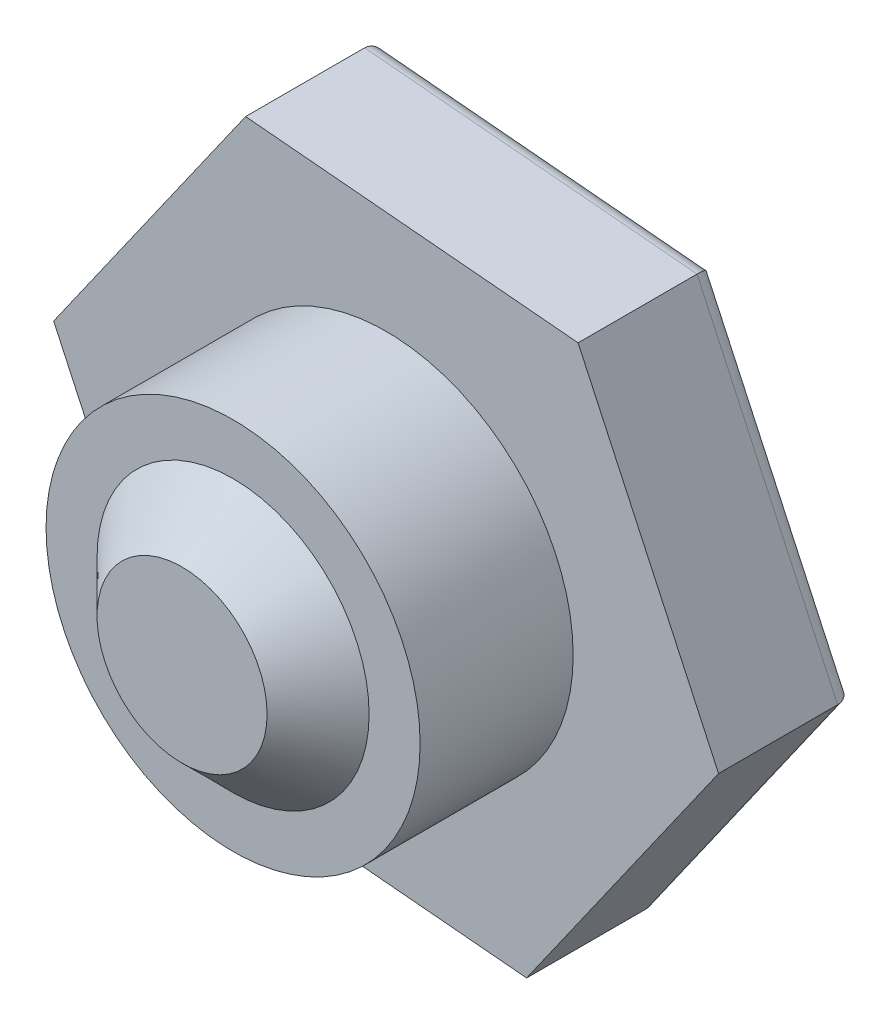
ISO-10303-21;
HEADER;
FILE_DESCRIPTION(('STEP AP214'),'2;1');
FILE_NAME('part.step','',(''),(''),'','','');
FILE_SCHEMA(('AUTOMOTIVE_DESIGN { 1 0 10303 214 1 1 1 1 }'));
ENDSEC;
DATA;
#1=APPLICATION_CONTEXT('core data for automotive mechanical design processes');
#2=APPLICATION_PROTOCOL_DEFINITION('international standard','automotive_design',2000,#1);
#3=PRODUCT_CONTEXT('',#1,'mechanical');
#4=PRODUCT('Part','Part','',(#3));
#5=PRODUCT_RELATED_PRODUCT_CATEGORY('part','',(#4));
#6=PRODUCT_DEFINITION_FORMATION('','',#4);
#7=PRODUCT_DEFINITION_CONTEXT('part definition',#1,'design');
#8=PRODUCT_DEFINITION('design','',#6,#7);
#9=PRODUCT_DEFINITION_SHAPE('','',#8);
#10=(LENGTH_UNIT() NAMED_UNIT(*) SI_UNIT(.MILLI.,.METRE.));
#11=(NAMED_UNIT(*) PLANE_ANGLE_UNIT() SI_UNIT($,.RADIAN.));
#12=(NAMED_UNIT(*) SI_UNIT($,.STERADIAN.) SOLID_ANGLE_UNIT());
#13=UNCERTAINTY_MEASURE_WITH_UNIT(LENGTH_MEASURE(1.E-05),#10,'distance_accuracy_value','');
#14=(GEOMETRIC_REPRESENTATION_CONTEXT(3) GLOBAL_UNCERTAINTY_ASSIGNED_CONTEXT((#13)) GLOBAL_UNIT_ASSIGNED_CONTEXT((#10,
#11,#12)) REPRESENTATION_CONTEXT('',''));
#15=CARTESIAN_POINT('',(0.,0.,0.));
#16=DIRECTION('',(0.,0.,1.));
#17=DIRECTION('',(1.,0.,0.));
#18=AXIS2_PLACEMENT_3D('',#15,#16,#17);
#19=CARTESIAN_POINT('',(0.,0.,9.));
#20=DIRECTION('',(0.,0.,1.));
#21=DIRECTION('',(1.,0.,0.));
#22=AXIS2_PLACEMENT_3D('',#19,#20,#21);
#23=PLANE('',#22);
#24=CARTESIAN_POINT('',(0.,0.,9.));
#25=DIRECTION('',(0.,0.,1.));
#26=DIRECTION('',(1.,0.,0.));
#27=AXIS2_PLACEMENT_3D('',#24,#25,#26);
#28=CIRCLE('',#27,11.);
#29=CARTESIAN_POINT('',(11.,0.,9.));
#30=VERTEX_POINT('',#29);
#31=EDGE_CURVE('E158',#30,#30,#28,.T.);
#32=ORIENTED_EDGE('',*,*,#31,.T.);
#33=EDGE_LOOP('',(#32));
#34=FACE_BOUND('',#33,.T.);
#35=CARTESIAN_POINT('',(0.,0.,9.));
#36=DIRECTION('',(0.,0.,1.));
#37=DIRECTION('',(1.,0.,0.));
#38=AXIS2_PLACEMENT_3D('',#35,#36,#37);
#39=CIRCLE('',#38,8.);
#40=CARTESIAN_POINT('',(8.,0.,9.));
#41=VERTEX_POINT('',#40);
#42=EDGE_CURVE('E413',#41,#41,#39,.T.);
#43=ORIENTED_EDGE('',*,*,#42,.F.);
#44=EDGE_LOOP('',(#43));
#45=FACE_BOUND('',#44,.T.);
#46=ADVANCED_FACE('F40',(#34,#45),#23,.T.);
#47=CARTESIAN_POINT('',(0.,0.,9.));
#48=DIRECTION('',(0.,0.,-1.));
#49=DIRECTION('',(-1.,0.,0.));
#50=AXIS2_PLACEMENT_3D('',#47,#48,#49);
#51=CYLINDRICAL_SURFACE('',#50,11.);
#52=ORIENTED_EDGE('',*,*,#31,.F.);
#53=EDGE_LOOP('',(#52));
#54=FACE_BOUND('',#53,.T.);
#55=CARTESIAN_POINT('',(0.,0.,0.));
#56=DIRECTION('',(0.,0.,1.));
#57=DIRECTION('',(1.,0.,0.));
#58=AXIS2_PLACEMENT_3D('',#55,#56,#57);
#59=CIRCLE('',#58,11.);
#60=CARTESIAN_POINT('',(11.,0.,0.));
#61=VERTEX_POINT('',#60);
#62=EDGE_CURVE('E118',#61,#61,#59,.T.);
#63=ORIENTED_EDGE('',*,*,#62,.T.);
#64=EDGE_LOOP('',(#63));
#65=FACE_BOUND('',#64,.T.);
#66=ADVANCED_FACE('F240',(#54,#65),#51,.T.);
#67=CARTESIAN_POINT('',(11.2892059741535,16.0588655205301,-8.));
#68=DIRECTION('',(-0.907093954646099,-0.420928209371267,0.));
#69=DIRECTION('',(0.420928209371267,-0.907093954646099,0.));
#70=AXIS2_PLACEMENT_3D('',#67,#68,#69);
#71=PLANE('',#70);
#72=DIRECTION('',(0.,0.,1.));
#73=VECTOR('',#72,1.);
#74=CARTESIAN_POINT('',(19.5519884838138,-1.74730640190698,-8.));
#75=LINE('',#74,#73);
#76=CARTESIAN_POINT('',(19.5519884838138,-1.74730640190698,-7.));
#77=VERTEX_POINT('',#76);
#78=CARTESIAN_POINT('',(19.5519884838138,-1.74730640190698,0.));
#79=VERTEX_POINT('',#78);
#80=EDGE_CURVE('E110',#77,#79,#75,.T.);
#81=ORIENTED_EDGE('',*,*,#80,.F.);
#82=DIRECTION('',(0.420928209371267,-0.907093954646099,0.));
#83=VECTOR('',#82,1.);
#84=CARTESIAN_POINT('',(11.2892059741535,16.0588655205301,-7.));
#85=LINE('',#84,#83);
#86=CARTESIAN_POINT('',(11.2892059741535,16.0588655205301,-7.));
#87=VERTEX_POINT('',#86);
#88=EDGE_CURVE('E12',#77,#87,#85,.F.);
#89=ORIENTED_EDGE('',*,*,#88,.T.);
#90=DIRECTION('',(0.,0.,1.));
#91=VECTOR('',#90,1.);
#92=CARTESIAN_POINT('',(11.2892059741535,16.0588655205301,-8.));
#93=LINE('',#92,#91);
#94=CARTESIAN_POINT('',(11.2892059741535,16.0588655205301,0.));
#95=VERTEX_POINT('',#94);
#96=EDGE_CURVE('E132',#87,#95,#93,.T.);
#97=ORIENTED_EDGE('',*,*,#96,.T.);
#98=DIRECTION('',(0.420928209371267,-0.907093954646099,0.));
#99=VECTOR('',#98,1.);
#100=CARTESIAN_POINT('',(11.2892059741535,16.0588655205301,0.));
#101=LINE('',#100,#99);
#102=EDGE_CURVE('E125',#95,#79,#101,.T.);
#103=ORIENTED_EDGE('',*,*,#102,.T.);
#104=EDGE_LOOP('',(#81,#89,#97,#103));
#105=FACE_BOUND('',#104,.T.);
#106=ADVANCED_FACE('F130',(#105),#71,.F.);
#107=CARTESIAN_POINT('',(19.5519884838138,-1.74730640190698,-8.));
#108=DIRECTION('',(-0.818081499808062,0.575102303657177,0.));
#109=DIRECTION('',(-0.575102303657177,-0.818081499808062,0.));
#110=AXIS2_PLACEMENT_3D('',#107,#108,#109);
#111=PLANE('',#110);
#112=DIRECTION('',(0.,0.,1.));
#113=VECTOR('',#112,1.);
#114=CARTESIAN_POINT('',(8.26278250966028,-17.8061719224371,-8.));
#115=LINE('',#114,#113);
#116=CARTESIAN_POINT('',(8.26278250966028,-17.8061719224371,-7.));
#117=VERTEX_POINT('',#116);
#118=CARTESIAN_POINT('',(8.26278250966028,-17.8061719224371,0.));
#119=VERTEX_POINT('',#118);
#120=EDGE_CURVE('E119',#117,#119,#115,.T.);
#121=ORIENTED_EDGE('',*,*,#120,.F.);
#122=DIRECTION('',(-0.575102303657177,-0.818081499808062,0.));
#123=VECTOR('',#122,1.);
#124=CARTESIAN_POINT('',(19.5519884838138,-1.74730640190698,-7.));
#125=LINE('',#124,#123);
#126=EDGE_CURVE('E49',#117,#77,#125,.F.);
#127=ORIENTED_EDGE('',*,*,#126,.T.);
#128=ORIENTED_EDGE('',*,*,#80,.T.);
#129=DIRECTION('',(-0.575102303657177,-0.818081499808062,0.));
#130=VECTOR('',#129,1.);
#131=CARTESIAN_POINT('',(19.5519884838138,-1.74730640190698,0.));
#132=LINE('',#131,#130);
#133=EDGE_CURVE('E113',#79,#119,#132,.T.);
#134=ORIENTED_EDGE('',*,*,#133,.T.);
#135=EDGE_LOOP('',(#121,#127,#128,#134));
#136=FACE_BOUND('',#135,.T.);
#137=ADVANCED_FACE('F112',(#136),#111,.F.);
#138=CARTESIAN_POINT('',(8.26278250966028,-17.8061719224371,-8.));
#139=DIRECTION('',(0.0890124548380372,0.996030513028445,0.));
#140=DIRECTION('',(-0.996030513028445,0.0890124548380372,0.));
#141=AXIS2_PLACEMENT_3D('',#138,#139,#140);
#142=PLANE('',#141);
#143=DIRECTION('',(0.,0.,1.));
#144=VECTOR('',#143,1.);
#145=CARTESIAN_POINT('',(-11.2892059741535,-16.0588655205301,-8.));
#146=LINE('',#145,#144);
#147=CARTESIAN_POINT('',(-11.2892059741535,-16.0588655205301,-7.));
#148=VERTEX_POINT('',#147);
#149=CARTESIAN_POINT('',(-11.2892059741535,-16.0588655205301,0.));
#150=VERTEX_POINT('',#149);
#151=EDGE_CURVE('E155',#148,#150,#146,.T.);
#152=ORIENTED_EDGE('',*,*,#151,.F.);
#153=DIRECTION('',(-0.996030513028445,0.0890124548380372,0.));
#154=VECTOR('',#153,1.);
#155=CARTESIAN_POINT('',(8.26278250966028,-17.8061719224371,-7.));
#156=LINE('',#155,#154);
#157=EDGE_CURVE('E64',#148,#117,#156,.F.);
#158=ORIENTED_EDGE('',*,*,#157,.T.);
#159=ORIENTED_EDGE('',*,*,#120,.T.);
#160=DIRECTION('',(-0.996030513028445,0.0890124548380372,0.));
#161=VECTOR('',#160,1.);
#162=CARTESIAN_POINT('',(8.26278250966028,-17.8061719224371,0.));
#163=LINE('',#162,#161);
#164=EDGE_CURVE('E128',#119,#150,#163,.T.);
#165=ORIENTED_EDGE('',*,*,#164,.T.);
#166=EDGE_LOOP('',(#152,#158,#159,#165));
#167=FACE_BOUND('',#166,.T.);
#168=ADVANCED_FACE('F321',(#167),#142,.F.);
#169=CARTESIAN_POINT('',(-11.2892059741535,-16.0588655205301,-8.));
#170=DIRECTION('',(0.907093954646099,0.420928209371267,0.));
#171=DIRECTION('',(-0.420928209371267,0.907093954646099,0.));
#172=AXIS2_PLACEMENT_3D('',#169,#170,#171);
#173=PLANE('',#172);
#174=DIRECTION('',(0.,0.,1.));
#175=VECTOR('',#174,1.);
#176=CARTESIAN_POINT('',(-19.5519884838138,1.74730640190698,-8.));
#177=LINE('',#176,#175);
#178=CARTESIAN_POINT('',(-19.5519884838138,1.74730640190698,-7.));
#179=VERTEX_POINT('',#178);
#180=CARTESIAN_POINT('',(-19.5519884838138,1.74730640190698,0.));
#181=VERTEX_POINT('',#180);
#182=EDGE_CURVE('E153',#179,#181,#177,.T.);
#183=ORIENTED_EDGE('',*,*,#182,.F.);
#184=DIRECTION('',(-0.420928209371267,0.907093954646099,0.));
#185=VECTOR('',#184,1.);
#186=CARTESIAN_POINT('',(-11.2892059741535,-16.0588655205301,-7.));
#187=LINE('',#186,#185);
#188=EDGE_CURVE('E181',#179,#148,#187,.F.);
#189=ORIENTED_EDGE('',*,*,#188,.T.);
#190=ORIENTED_EDGE('',*,*,#151,.T.);
#191=DIRECTION('',(-0.420928209371267,0.907093954646099,0.));
#192=VECTOR('',#191,1.);
#193=CARTESIAN_POINT('',(-11.2892059741535,-16.0588655205301,0.));
#194=LINE('',#193,#192);
#195=EDGE_CURVE('E142',#150,#181,#194,.T.);
#196=ORIENTED_EDGE('',*,*,#195,.T.);
#197=EDGE_LOOP('',(#183,#189,#190,#196));
#198=FACE_BOUND('',#197,.T.);
#199=ADVANCED_FACE('F229',(#198),#173,.F.);
#200=CARTESIAN_POINT('',(-19.5519884838138,1.74730640190698,-8.));
#201=DIRECTION('',(0.818081499808062,-0.575102303657177,0.));
#202=DIRECTION('',(0.575102303657177,0.818081499808062,0.));
#203=AXIS2_PLACEMENT_3D('',#200,#201,#202);
#204=PLANE('',#203);
#205=DIRECTION('',(0.,0.,1.));
#206=VECTOR('',#205,1.);
#207=CARTESIAN_POINT('',(-8.26278250966028,17.8061719224371,-8.));
#208=LINE('',#207,#206);
#209=CARTESIAN_POINT('',(-8.26278250966028,17.8061719224371,-7.));
#210=VERTEX_POINT('',#209);
#211=CARTESIAN_POINT('',(-8.26278250966028,17.8061719224371,0.));
#212=VERTEX_POINT('',#211);
#213=EDGE_CURVE('E151',#210,#212,#208,.T.);
#214=ORIENTED_EDGE('',*,*,#213,.F.);
#215=DIRECTION('',(0.575102303657177,0.818081499808062,0.));
#216=VECTOR('',#215,1.);
#217=CARTESIAN_POINT('',(-19.5519884838138,1.74730640190698,-7.));
#218=LINE('',#217,#216);
#219=EDGE_CURVE('E179',#210,#179,#218,.F.);
#220=ORIENTED_EDGE('',*,*,#219,.T.);
#221=ORIENTED_EDGE('',*,*,#182,.T.);
#222=DIRECTION('',(0.575102303657177,0.818081499808062,0.));
#223=VECTOR('',#222,1.);
#224=CARTESIAN_POINT('',(-19.5519884838138,1.74730640190698,0.));
#225=LINE('',#224,#223);
#226=EDGE_CURVE('E145',#181,#212,#225,.T.);
#227=ORIENTED_EDGE('',*,*,#226,.T.);
#228=EDGE_LOOP('',(#214,#220,#221,#227));
#229=FACE_BOUND('',#228,.T.);
#230=ADVANCED_FACE('F226',(#229),#204,.F.);
#231=CARTESIAN_POINT('',(-8.26278250966028,17.8061719224371,-8.));
#232=DIRECTION('',(-0.0890124548380371,-0.996030513028445,0.));
#233=DIRECTION('',(0.996030513028445,-0.0890124548380371,0.));
#234=AXIS2_PLACEMENT_3D('',#231,#232,#233);
#235=PLANE('',#234);
#236=ORIENTED_EDGE('',*,*,#96,.F.);
#237=DIRECTION('',(0.996030513028445,-0.0890124548380371,0.));
#238=VECTOR('',#237,1.);
#239=CARTESIAN_POINT('',(-8.26278250966028,17.8061719224371,-7.));
#240=LINE('',#239,#238);
#241=EDGE_CURVE('E176',#87,#210,#240,.F.);
#242=ORIENTED_EDGE('',*,*,#241,.T.);
#243=ORIENTED_EDGE('',*,*,#213,.T.);
#244=DIRECTION('',(0.996030513028445,-0.0890124548380371,0.));
#245=VECTOR('',#244,1.);
#246=CARTESIAN_POINT('',(-8.26278250966028,17.8061719224371,0.));
#247=LINE('',#246,#245);
#248=EDGE_CURVE('E148',#212,#95,#247,.T.);
#249=ORIENTED_EDGE('',*,*,#248,.T.);
#250=EDGE_LOOP('',(#236,#242,#243,#249));
#251=FACE_BOUND('',#250,.T.);
#252=ADVANCED_FACE('F215',(#251),#235,.F.);
#253=CARTESIAN_POINT('',(0.,0.,-8.));
#254=DIRECTION('',(0.,0.,-1.));
#255=DIRECTION('',(-1.,0.,0.));
#256=AXIS2_PLACEMENT_3D('',#253,#254,#255);
#257=PLANE('',#256);
#258=DIRECTION('',(0.575102303657177,0.818081499808062,0.));
#259=VECTOR('',#258,1.);
#260=CARTESIAN_POINT('',(-7.44470100985222,17.2310696187799,-8.));
#261=LINE('',#260,#259);
#262=CARTESIAN_POINT('',(-18.4018715141777,1.64452367238304,-8.));
#263=VERTEX_POINT('',#262);
#264=CARTESIAN_POINT('',(-7.77673647968026,16.7587500446466,-8.));
#265=VERTEX_POINT('',#264);
#266=EDGE_CURVE('E171',#263,#265,#261,.T.);
#267=ORIENTED_EDGE('',*,*,#266,.T.);
#268=DIRECTION('',(0.996030513028445,-0.0890124548380371,0.));
#269=VECTOR('',#268,1.);
#270=CARTESIAN_POINT('',(11.2001935193155,15.0628350075016,-8.));
#271=LINE('',#270,#269);
#272=CARTESIAN_POINT('',(10.6251350344974,15.1142263722636,-8.));
#273=VERTEX_POINT('',#272);
#274=EDGE_CURVE('E173',#265,#273,#271,.T.);
#275=ORIENTED_EDGE('',*,*,#274,.T.);
#276=DIRECTION('',(0.420928209371267,-0.907093954646099,0.));
#277=VECTOR('',#276,1.);
#278=CARTESIAN_POINT('',(18.6448945291677,-2.16823461127825,-8.));
#279=LINE('',#278,#277);
#280=CARTESIAN_POINT('',(18.4018715141777,-1.64452367238304,-8.));
#281=VERTEX_POINT('',#280);
#282=EDGE_CURVE('E161',#273,#281,#279,.T.);
#283=ORIENTED_EDGE('',*,*,#282,.T.);
#284=DIRECTION('',(-0.575102303657177,-0.818081499808062,0.));
#285=VECTOR('',#284,1.);
#286=CARTESIAN_POINT('',(7.44470100985222,-17.2310696187799,-8.));
#287=LINE('',#286,#285);
#288=CARTESIAN_POINT('',(7.77673647968026,-16.7587500446466,-8.));
#289=VERTEX_POINT('',#288);
#290=EDGE_CURVE('E165',#281,#289,#287,.T.);
#291=ORIENTED_EDGE('',*,*,#290,.T.);
#292=DIRECTION('',(-0.996030513028445,0.0890124548380372,0.));
#293=VECTOR('',#292,1.);
#294=CARTESIAN_POINT('',(-11.2001935193155,-15.0628350075016,-8.));
#295=LINE('',#294,#293);
#296=CARTESIAN_POINT('',(-10.6251350344975,-15.1142263722636,-8.));
#297=VERTEX_POINT('',#296);
#298=EDGE_CURVE('E167',#289,#297,#295,.T.);
#299=ORIENTED_EDGE('',*,*,#298,.T.);
#300=DIRECTION('',(-0.420928209371267,0.907093954646099,0.));
#301=VECTOR('',#300,1.);
#302=CARTESIAN_POINT('',(-18.6448945291677,2.16823461127825,-8.));
#303=LINE('',#302,#301);
#304=EDGE_CURVE('E169',#297,#263,#303,.T.);
#305=ORIENTED_EDGE('',*,*,#304,.T.);
#306=EDGE_LOOP('',(#267,#275,#283,#291,#299,#305));
#307=FACE_BOUND('',#306,.T.);
#308=ADVANCED_FACE('F205',(#307),#257,.T.);
#309=CARTESIAN_POINT('',(0.,0.,0.));
#310=DIRECTION('',(0.,0.,-1.));
#311=DIRECTION('',(-1.,0.,0.));
#312=AXIS2_PLACEMENT_3D('',#309,#310,#311);
#313=PLANE('',#312);
#314=ORIENTED_EDGE('',*,*,#62,.F.);
#315=EDGE_LOOP('',(#314));
#316=FACE_BOUND('',#315,.T.);
#317=ORIENTED_EDGE('',*,*,#102,.F.);
#318=ORIENTED_EDGE('',*,*,#248,.F.);
#319=ORIENTED_EDGE('',*,*,#226,.F.);
#320=ORIENTED_EDGE('',*,*,#195,.F.);
#321=ORIENTED_EDGE('',*,*,#164,.F.);
#322=ORIENTED_EDGE('',*,*,#133,.F.);
#323=EDGE_LOOP('',(#317,#318,#319,#320,#321,#322));
#324=FACE_BOUND('',#323,.T.);
#325=ADVANCED_FACE('F123',(#316,#324),#313,.F.);
#326=CARTESIAN_POINT('',(-1.4241992774086,-15.9364882084551,-7.));
#327=DIRECTION('',(0.996030513028445,-0.0890124548380372,0.));
#328=DIRECTION('',(0.0890124548380372,0.996030513028445,0.));
#329=AXIS2_PLACEMENT_3D('',#326,#327,#328);
#330=CYLINDRICAL_SURFACE('',#329,1.);
#331=CARTESIAN_POINT('',(7.77673647968026,-16.7587500446466,-7.));
#332=DIRECTION('',(0.907093954646099,0.420928209371267,0.));
#333=DIRECTION('',(-0.420928209371267,0.907093954646099,0.));
#334=AXIS2_PLACEMENT_3D('',#331,#332,#333);
#335=ELLIPSE('',#334,1.15470053837925,1.);
#336=EDGE_CURVE('E136',#117,#289,#335,.T.);
#337=ORIENTED_EDGE('',*,*,#336,.F.);
#338=ORIENTED_EDGE('',*,*,#157,.F.);
#339=CARTESIAN_POINT('',(-10.6251350344975,-15.1142263722636,-7.));
#340=DIRECTION('',(0.818081499808062,-0.575102303657178,0.));
#341=DIRECTION('',(0.575102303657178,0.818081499808062,0.));
#342=AXIS2_PLACEMENT_3D('',#339,#340,#341);
#343=ELLIPSE('',#342,1.15470053837925,1.);
#344=EDGE_CURVE('E44',#297,#148,#343,.F.);
#345=ORIENTED_EDGE('',*,*,#344,.F.);
#346=ORIENTED_EDGE('',*,*,#298,.F.);
#347=EDGE_LOOP('',(#337,#338,#345,#346));
#348=FACE_BOUND('',#347,.T.);
#349=ADVANCED_FACE('F42',(#348),#330,.T.);
#350=CARTESIAN_POINT('',(-14.5135032743376,-6.73485134994027,-7.));
#351=DIRECTION('',(0.420928209371267,-0.907093954646099,0.));
#352=DIRECTION('',(0.907093954646099,0.420928209371267,0.));
#353=AXIS2_PLACEMENT_3D('',#350,#351,#352);
#354=CYLINDRICAL_SURFACE('',#353,1.);
#355=ORIENTED_EDGE('',*,*,#344,.T.);
#356=ORIENTED_EDGE('',*,*,#188,.F.);
#357=CARTESIAN_POINT('',(-18.4018715141777,1.64452367238304,-7.));
#358=DIRECTION('',(-0.089012454838037,-0.996030513028445,0.));
#359=DIRECTION('',(0.996030513028445,-0.0890124548380371,0.));
#360=AXIS2_PLACEMENT_3D('',#357,#358,#359);
#361=ELLIPSE('',#360,1.15470053837925,1.);
#362=EDGE_CURVE('E193',#263,#179,#361,.F.);
#363=ORIENTED_EDGE('',*,*,#362,.F.);
#364=ORIENTED_EDGE('',*,*,#304,.F.);
#365=EDGE_LOOP('',(#355,#356,#363,#364));
#366=FACE_BOUND('',#365,.T.);
#367=ADVANCED_FACE('F232',(#366),#354,.T.);
#368=CARTESIAN_POINT('',(13.089303996929,-9.20163685851484,-7.));
#369=DIRECTION('',(0.575102303657177,0.818081499808062,0.));
#370=DIRECTION('',(-0.818081499808062,0.575102303657177,0.));
#371=AXIS2_PLACEMENT_3D('',#368,#369,#370);
#372=CYLINDRICAL_SURFACE('',#371,1.);
#373=ORIENTED_EDGE('',*,*,#336,.T.);
#374=ORIENTED_EDGE('',*,*,#290,.F.);
#375=CARTESIAN_POINT('',(18.4018715141777,-1.64452367238304,-7.));
#376=DIRECTION('',(0.0890124548380369,0.996030513028445,0.));
#377=DIRECTION('',(-0.996030513028445,0.089012454838037,0.));
#378=AXIS2_PLACEMENT_3D('',#375,#376,#377);
#379=ELLIPSE('',#378,1.15470053837925,1.);
#380=EDGE_CURVE('E190',#77,#281,#379,.T.);
#381=ORIENTED_EDGE('',*,*,#380,.F.);
#382=ORIENTED_EDGE('',*,*,#126,.F.);
#383=EDGE_LOOP('',(#373,#374,#381,#382));
#384=FACE_BOUND('',#383,.T.);
#385=ADVANCED_FACE('F199',(#384),#372,.T.);
#386=CARTESIAN_POINT('',(-13.089303996929,9.20163685851484,-7.));
#387=DIRECTION('',(-0.575102303657177,-0.818081499808062,0.));
#388=DIRECTION('',(0.818081499808062,-0.575102303657177,0.));
#389=AXIS2_PLACEMENT_3D('',#386,#387,#388);
#390=CYLINDRICAL_SURFACE('',#389,1.);
#391=ORIENTED_EDGE('',*,*,#362,.T.);
#392=ORIENTED_EDGE('',*,*,#219,.F.);
#393=CARTESIAN_POINT('',(-7.77673647968026,16.7587500446466,-7.));
#394=DIRECTION('',(-0.907093954646099,-0.420928209371267,0.));
#395=DIRECTION('',(0.420928209371267,-0.907093954646099,0.));
#396=AXIS2_PLACEMENT_3D('',#393,#394,#395);
#397=ELLIPSE('',#396,1.15470053837925,1.);
#398=EDGE_CURVE('E187',#265,#210,#397,.F.);
#399=ORIENTED_EDGE('',*,*,#398,.F.);
#400=ORIENTED_EDGE('',*,*,#266,.F.);
#401=EDGE_LOOP('',(#391,#392,#399,#400));
#402=FACE_BOUND('',#401,.T.);
#403=ADVANCED_FACE('F223',(#402),#390,.T.);
#404=CARTESIAN_POINT('',(14.5135032743376,6.73485134994028,-7.));
#405=DIRECTION('',(-0.420928209371267,0.907093954646099,0.));
#406=DIRECTION('',(-0.907093954646099,-0.420928209371267,0.));
#407=AXIS2_PLACEMENT_3D('',#404,#405,#406);
#408=CYLINDRICAL_SURFACE('',#407,1.);
#409=ORIENTED_EDGE('',*,*,#380,.T.);
#410=ORIENTED_EDGE('',*,*,#282,.F.);
#411=CARTESIAN_POINT('',(10.6251350344974,15.1142263722636,-7.));
#412=DIRECTION('',(-0.818081499808062,0.575102303657177,0.));
#413=DIRECTION('',(0.575102303657178,0.818081499808062,0.));
#414=AXIS2_PLACEMENT_3D('',#411,#412,#413);
#415=ELLIPSE('',#414,1.15470053837925,1.);
#416=EDGE_CURVE('E185',#87,#273,#415,.T.);
#417=ORIENTED_EDGE('',*,*,#416,.F.);
#418=ORIENTED_EDGE('',*,*,#88,.F.);
#419=EDGE_LOOP('',(#409,#410,#417,#418));
#420=FACE_BOUND('',#419,.T.);
#421=ADVANCED_FACE('F211',(#420),#408,.T.);
#422=CARTESIAN_POINT('',(1.42419927740859,15.9364882084551,-7.));
#423=DIRECTION('',(-0.996030513028445,0.0890124548380371,0.));
#424=DIRECTION('',(-0.0890124548380371,-0.996030513028445,0.));
#425=AXIS2_PLACEMENT_3D('',#422,#423,#424);
#426=CYLINDRICAL_SURFACE('',#425,1.);
#427=ORIENTED_EDGE('',*,*,#398,.T.);
#428=ORIENTED_EDGE('',*,*,#241,.F.);
#429=ORIENTED_EDGE('',*,*,#416,.T.);
#430=ORIENTED_EDGE('',*,*,#274,.F.);
#431=EDGE_LOOP('',(#427,#428,#429,#430));
#432=FACE_BOUND('',#431,.T.);
#433=ADVANCED_FACE('F218',(#432),#426,.T.);
#434=CARTESIAN_POINT('',(0.,0.,12.));
#435=DIRECTION('',(0.,0.,1.));
#436=DIRECTION('',(1.,0.,0.));
#437=AXIS2_PLACEMENT_3D('',#434,#435,#436);
#438=PLANE('',#437);
#439=CARTESIAN_POINT('',(0.,0.,12.));
#440=DIRECTION('',(0.,0.,1.));
#441=DIRECTION('',(1.,0.,0.));
#442=AXIS2_PLACEMENT_3D('',#439,#440,#441);
#443=CIRCLE('',#442,5.);
#444=CARTESIAN_POINT('',(5.,0.,12.));
#445=VERTEX_POINT('',#444);
#446=EDGE_CURVE('E188',#445,#445,#443,.T.);
#447=ORIENTED_EDGE('',*,*,#446,.T.);
#448=EDGE_LOOP('',(#447));
#449=FACE_BOUND('',#448,.T.);
#450=ADVANCED_FACE('F254',(#449),#438,.T.);
#451=CARTESIAN_POINT('',(0.,0.,12.));
#452=DIRECTION('',(0.,0.,-1.));
#453=DIRECTION('',(-1.,0.,0.));
#454=AXIS2_PLACEMENT_3D('',#451,#452,#453);
#455=CONICAL_SURFACE('',#454,5.,0.785398163397448);
#456=ORIENTED_EDGE('',*,*,#42,.T.);
#457=EDGE_LOOP('',(#456));
#458=FACE_BOUND('',#457,.T.);
#459=ORIENTED_EDGE('',*,*,#446,.F.);
#460=EDGE_LOOP('',(#459));
#461=FACE_BOUND('',#460,.T.);
#462=ADVANCED_FACE('F277',(#458,#461),#455,.T.);
#463=CLOSED_SHELL('',(#46,#66,#106,#137,#168,#199,#230,#252,#308,#325,#349,#367,#385,#403,#421,
#433,#450,#462));
#464=MANIFOLD_SOLID_BREP('B2',#463);
#465=ADVANCED_BREP_SHAPE_REPRESENTATION('',(#18,#464),#14);
#466=SHAPE_DEFINITION_REPRESENTATION(#9,#465);
ENDSEC;
END-ISO-10303-21;
